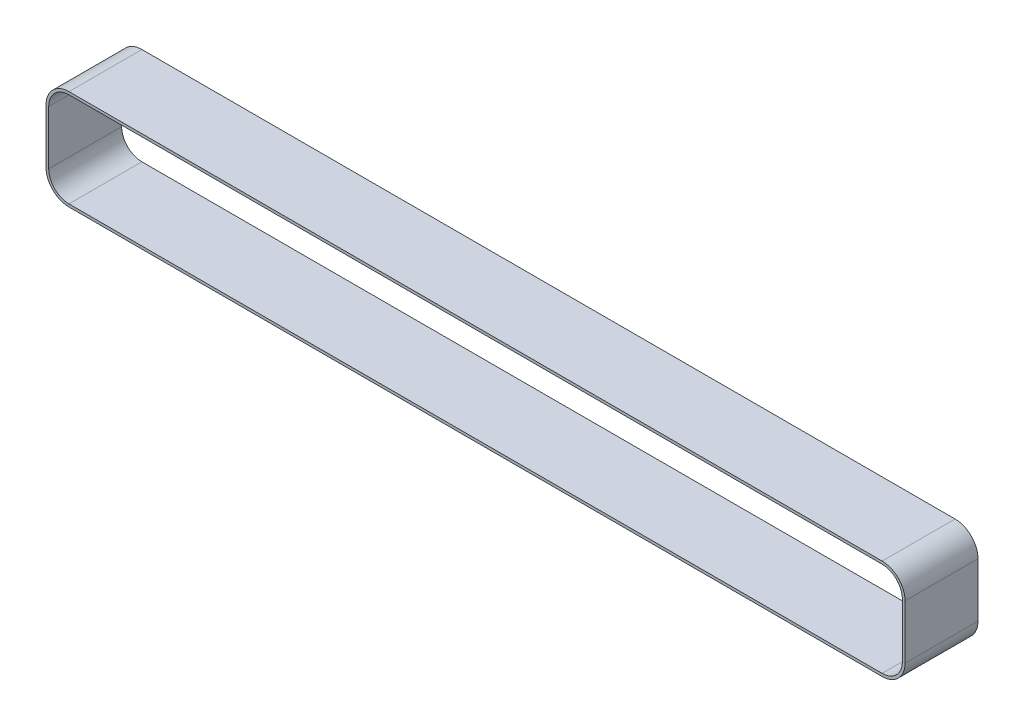
ISO-10303-21;
HEADER;
FILE_DESCRIPTION(('STEP AP214'),'2;1');
FILE_NAME('part.step','',(''),(''),'','','');
FILE_SCHEMA(('AUTOMOTIVE_DESIGN { 1 0 10303 214 1 1 1 1 }'));
ENDSEC;
DATA;
#1=APPLICATION_CONTEXT('core data for automotive mechanical design processes');
#2=APPLICATION_PROTOCOL_DEFINITION('international standard','automotive_design',2000,#1);
#3=PRODUCT_CONTEXT('',#1,'mechanical');
#4=PRODUCT('Part','Part','',(#3));
#5=PRODUCT_RELATED_PRODUCT_CATEGORY('part','',(#4));
#6=PRODUCT_DEFINITION_FORMATION('','',#4);
#7=PRODUCT_DEFINITION_CONTEXT('part definition',#1,'design');
#8=PRODUCT_DEFINITION('design','',#6,#7);
#9=PRODUCT_DEFINITION_SHAPE('','',#8);
#10=(LENGTH_UNIT() NAMED_UNIT(*) SI_UNIT(.MILLI.,.METRE.));
#11=(NAMED_UNIT(*) PLANE_ANGLE_UNIT() SI_UNIT($,.RADIAN.));
#12=(NAMED_UNIT(*) SI_UNIT($,.STERADIAN.) SOLID_ANGLE_UNIT());
#13=UNCERTAINTY_MEASURE_WITH_UNIT(LENGTH_MEASURE(1.E-05),#10,'distance_accuracy_value','');
#14=(GEOMETRIC_REPRESENTATION_CONTEXT(3) GLOBAL_UNCERTAINTY_ASSIGNED_CONTEXT((#13)) GLOBAL_UNIT_ASSIGNED_CONTEXT((#10,
#11,#12)) REPRESENTATION_CONTEXT('',''));
#15=CARTESIAN_POINT('',(0.,0.,0.));
#16=DIRECTION('',(0.,0.,1.));
#17=DIRECTION('',(1.,0.,0.));
#18=AXIS2_PLACEMENT_3D('',#15,#16,#17);
#19=CARTESIAN_POINT('',(371.394917120642,42.8157017452683,-232.556360518351));
#20=DIRECTION('',(1.,0.,0.));
#21=DIRECTION('',(0.,0.,-1.));
#22=AXIS2_PLACEMENT_3D('',#19,#20,#21);
#23=PLANE('',#22);
#24=DIRECTION('',(0.,1.,0.));
#25=VECTOR('',#24,1.);
#26=CARTESIAN_POINT('',(371.394917120642,60.3157017452683,-259.556360518351));
#27=LINE('',#26,#25);
#28=CARTESIAN_POINT('',(371.394917120642,52.8157017452683,-259.556360518351));
#29=VERTEX_POINT('',#28);
#30=CARTESIAN_POINT('',(371.394917120642,32.8157017452683,-259.556360518351));
#31=VERTEX_POINT('',#30);
#32=EDGE_CURVE('E178',#29,#31,#27,.F.);
#33=ORIENTED_EDGE('',*,*,#32,.F.);
#34=DIRECTION('',(0.,0.,-1.));
#35=VECTOR('',#34,1.);
#36=CARTESIAN_POINT('',(371.394917120642,52.8157017452683,-232.556360518351));
#37=LINE('',#36,#35);
#38=CARTESIAN_POINT('',(371.394917120642,52.8157017452683,-232.556360518351));
#39=VERTEX_POINT('',#38);
#40=EDGE_CURVE('E175',#29,#39,#37,.F.);
#41=ORIENTED_EDGE('',*,*,#40,.T.);
#42=DIRECTION('',(0.,1.,0.));
#43=VECTOR('',#42,1.);
#44=CARTESIAN_POINT('',(371.394917120642,58.9985567989127,-232.556360518351));
#45=LINE('',#44,#43);
#46=CARTESIAN_POINT('',(371.394917120642,32.8157017452683,-232.556360518351));
#47=VERTEX_POINT('',#46);
#48=EDGE_CURVE('E126',#39,#47,#45,.F.);
#49=ORIENTED_EDGE('',*,*,#48,.T.);
#50=DIRECTION('',(0.,0.,1.));
#51=VECTOR('',#50,1.);
#52=CARTESIAN_POINT('',(371.394917120642,32.8157017452683,-232.556360518351));
#53=LINE('',#52,#51);
#54=EDGE_CURVE('E136',#47,#31,#53,.F.);
#55=ORIENTED_EDGE('',*,*,#54,.T.);
#56=EDGE_LOOP('',(#33,#41,#49,#55));
#57=FACE_BOUND('',#56,.T.);
#58=ADVANCED_FACE('F17',(#57),#23,.T.);
#59=CARTESIAN_POINT('',(378.894917120642,32.8157017452683,-232.556360518351));
#60=DIRECTION('',(0.,0.,1.));
#61=DIRECTION('',(1.,0.,0.));
#62=AXIS2_PLACEMENT_3D('',#59,#60,#61);
#63=CYLINDRICAL_SURFACE('',#62,7.5);
#64=DIRECTION('',(0.,0.,1.));
#65=VECTOR('',#64,1.);
#66=CARTESIAN_POINT('',(378.894917120642,25.3157017452683,-232.556360518351));
#67=LINE('',#66,#65);
#68=CARTESIAN_POINT('',(378.894917120642,25.3157017452683,-259.556360518351));
#69=VERTEX_POINT('',#68);
#70=CARTESIAN_POINT('',(378.894917120642,25.3157017452683,-232.556360518351));
#71=VERTEX_POINT('',#70);
#72=EDGE_CURVE('E134',#69,#71,#67,.T.);
#73=ORIENTED_EDGE('',*,*,#72,.F.);
#74=CARTESIAN_POINT('',(378.894917120642,32.8157017452683,-259.556360518351));
#75=DIRECTION('',(0.,0.,1.));
#76=DIRECTION('',(1.,0.,0.));
#77=AXIS2_PLACEMENT_3D('',#74,#75,#76);
#78=CIRCLE('',#77,7.5);
#79=EDGE_CURVE('E220',#31,#69,#78,.T.);
#80=ORIENTED_EDGE('',*,*,#79,.F.);
#81=ORIENTED_EDGE('',*,*,#54,.F.);
#82=CARTESIAN_POINT('',(378.894917120642,32.8157017452683,-232.556360518351));
#83=DIRECTION('',(0.,0.,1.));
#84=DIRECTION('',(1.,0.,0.));
#85=AXIS2_PLACEMENT_3D('',#82,#83,#84);
#86=CIRCLE('',#85,7.5);
#87=EDGE_CURVE('E20',#47,#71,#86,.T.);
#88=ORIENTED_EDGE('',*,*,#87,.T.);
#89=EDGE_LOOP('',(#73,#80,#81,#88));
#90=FACE_BOUND('',#89,.T.);
#91=ADVANCED_FACE('F132',(#90),#63,.F.);
#92=CARTESIAN_POINT('',(679.894917120642,25.3157017452683,-232.556360518351));
#93=DIRECTION('',(0.,1.,0.));
#94=DIRECTION('',(0.,0.,1.));
#95=AXIS2_PLACEMENT_3D('',#92,#93,#94);
#96=PLANE('',#95);
#97=DIRECTION('',(-1.,0.,0.));
#98=VECTOR('',#97,1.);
#99=CARTESIAN_POINT('',(374.827683,25.3157017452683,-259.556360518351));
#100=LINE('',#99,#98);
#101=CARTESIAN_POINT('',(679.894917120642,25.3157017452683,-259.556360518351));
#102=VERTEX_POINT('',#101);
#103=EDGE_CURVE('E144',#69,#102,#100,.F.);
#104=ORIENTED_EDGE('',*,*,#103,.F.);
#105=ORIENTED_EDGE('',*,*,#72,.T.);
#106=DIRECTION('',(-1.,0.,0.));
#107=VECTOR('',#106,1.);
#108=CARTESIAN_POINT('',(450.519812437372,25.3157017452683,-232.556360518351));
#109=LINE('',#108,#107);
#110=CARTESIAN_POINT('',(679.894917120642,25.3157017452683,-232.556360518351));
#111=VERTEX_POINT('',#110);
#112=EDGE_CURVE('E139',#71,#111,#109,.F.);
#113=ORIENTED_EDGE('',*,*,#112,.T.);
#114=DIRECTION('',(0.,0.,1.));
#115=VECTOR('',#114,1.);
#116=CARTESIAN_POINT('',(679.894917120642,25.3157017452683,-232.556360518351));
#117=LINE('',#116,#115);
#118=EDGE_CURVE('E146',#111,#102,#117,.F.);
#119=ORIENTED_EDGE('',*,*,#118,.T.);
#120=EDGE_LOOP('',(#104,#105,#113,#119));
#121=FACE_BOUND('',#120,.T.);
#122=ADVANCED_FACE('F141',(#121),#96,.T.);
#123=CARTESIAN_POINT('',(679.894917120642,32.8157017452683,-232.556360518351));
#124=DIRECTION('',(0.,0.,1.));
#125=DIRECTION('',(1.,0.,0.));
#126=AXIS2_PLACEMENT_3D('',#123,#124,#125);
#127=CYLINDRICAL_SURFACE('',#126,7.5);
#128=DIRECTION('',(0.,0.,1.));
#129=VECTOR('',#128,1.);
#130=CARTESIAN_POINT('',(687.394917120642,32.8157017452683,-232.556360518351));
#131=LINE('',#130,#129);
#132=CARTESIAN_POINT('',(687.394917120642,32.8157017452683,-259.556360518351));
#133=VERTEX_POINT('',#132);
#134=CARTESIAN_POINT('',(687.394917120642,32.8157017452683,-232.556360518351));
#135=VERTEX_POINT('',#134);
#136=EDGE_CURVE('E188',#133,#135,#131,.T.);
#137=ORIENTED_EDGE('',*,*,#136,.F.);
#138=CARTESIAN_POINT('',(679.894917120642,32.8157017452683,-259.556360518351));
#139=DIRECTION('',(0.,0.,1.));
#140=DIRECTION('',(1.,0.,0.));
#141=AXIS2_PLACEMENT_3D('',#138,#139,#140);
#142=CIRCLE('',#141,7.5);
#143=EDGE_CURVE('E217',#102,#133,#142,.T.);
#144=ORIENTED_EDGE('',*,*,#143,.F.);
#145=ORIENTED_EDGE('',*,*,#118,.F.);
#146=CARTESIAN_POINT('',(679.894917120642,32.8157017452683,-232.556360518351));
#147=DIRECTION('',(0.,0.,1.));
#148=DIRECTION('',(1.,0.,0.));
#149=AXIS2_PLACEMENT_3D('',#146,#147,#148);
#150=CIRCLE('',#149,7.5);
#151=EDGE_CURVE('E152',#111,#135,#150,.T.);
#152=ORIENTED_EDGE('',*,*,#151,.T.);
#153=EDGE_LOOP('',(#137,#144,#145,#152));
#154=FACE_BOUND('',#153,.T.);
#155=ADVANCED_FACE('F416',(#154),#127,.F.);
#156=CARTESIAN_POINT('',(687.394917120642,42.8157017452683,-232.556360518351));
#157=DIRECTION('',(-1.,0.,0.));
#158=DIRECTION('',(0.,0.,1.));
#159=AXIS2_PLACEMENT_3D('',#156,#157,#158);
#160=PLANE('',#159);
#161=DIRECTION('',(0.,1.,0.));
#162=VECTOR('',#161,1.);
#163=CARTESIAN_POINT('',(687.394917120642,60.3157017452683,-259.556360518351));
#164=LINE('',#163,#162);
#165=CARTESIAN_POINT('',(687.394917120642,52.8157017452683,-259.556360518351));
#166=VERTEX_POINT('',#165);
#167=EDGE_CURVE('E216',#133,#166,#164,.T.);
#168=ORIENTED_EDGE('',*,*,#167,.F.);
#169=ORIENTED_EDGE('',*,*,#136,.T.);
#170=DIRECTION('',(0.,1.,0.));
#171=VECTOR('',#170,1.);
#172=CARTESIAN_POINT('',(687.394917120642,58.9985567989127,-232.556360518351));
#173=LINE('',#172,#171);
#174=CARTESIAN_POINT('',(687.394917120642,52.8157017452683,-232.556360518351));
#175=VERTEX_POINT('',#174);
#176=EDGE_CURVE('E154',#135,#175,#173,.T.);
#177=ORIENTED_EDGE('',*,*,#176,.T.);
#178=DIRECTION('',(0.,0.,-1.));
#179=VECTOR('',#178,1.);
#180=CARTESIAN_POINT('',(687.394917120642,52.8157017452683,-232.556360518351));
#181=LINE('',#180,#179);
#182=EDGE_CURVE('E186',#175,#166,#181,.T.);
#183=ORIENTED_EDGE('',*,*,#182,.T.);
#184=EDGE_LOOP('',(#168,#169,#177,#183));
#185=FACE_BOUND('',#184,.T.);
#186=ADVANCED_FACE('F241',(#185),#160,.T.);
#187=CARTESIAN_POINT('',(679.894917120642,52.8157017452683,-232.556360518351));
#188=DIRECTION('',(0.,0.,-1.));
#189=DIRECTION('',(-1.,0.,0.));
#190=AXIS2_PLACEMENT_3D('',#187,#188,#189);
#191=CYLINDRICAL_SURFACE('',#190,7.5);
#192=DIRECTION('',(0.,0.,-1.));
#193=VECTOR('',#192,1.);
#194=CARTESIAN_POINT('',(679.894917120642,60.3157017452683,-232.556360518351));
#195=LINE('',#194,#193);
#196=CARTESIAN_POINT('',(679.894917120642,60.3157017452683,-259.556360518351));
#197=VERTEX_POINT('',#196);
#198=CARTESIAN_POINT('',(679.894917120642,60.3157017452683,-232.556360518351));
#199=VERTEX_POINT('',#198);
#200=EDGE_CURVE('E182',#197,#199,#195,.F.);
#201=ORIENTED_EDGE('',*,*,#200,.F.);
#202=CARTESIAN_POINT('',(679.894917120642,52.8157017452683,-259.556360518351));
#203=DIRECTION('',(0.,0.,-1.));
#204=DIRECTION('',(-1.,0.,0.));
#205=AXIS2_PLACEMENT_3D('',#202,#203,#204);
#206=CIRCLE('',#205,7.5);
#207=EDGE_CURVE('E213',#166,#197,#206,.F.);
#208=ORIENTED_EDGE('',*,*,#207,.F.);
#209=ORIENTED_EDGE('',*,*,#182,.F.);
#210=CARTESIAN_POINT('',(679.894917120642,52.8157017452683,-232.556360518351));
#211=DIRECTION('',(0.,0.,-1.));
#212=DIRECTION('',(-1.,0.,0.));
#213=AXIS2_PLACEMENT_3D('',#210,#211,#212);
#214=CIRCLE('',#213,7.5);
#215=EDGE_CURVE('E235',#175,#199,#214,.F.);
#216=ORIENTED_EDGE('',*,*,#215,.T.);
#217=EDGE_LOOP('',(#201,#208,#209,#216));
#218=FACE_BOUND('',#217,.T.);
#219=ADVANCED_FACE('F243',(#218),#191,.F.);
#220=CARTESIAN_POINT('',(378.894917120642,60.3157017452683,-232.556360518351));
#221=DIRECTION('',(0.,-1.,0.));
#222=DIRECTION('',(0.,0.,-1.));
#223=AXIS2_PLACEMENT_3D('',#220,#221,#222);
#224=PLANE('',#223);
#225=DIRECTION('',(-1.,0.,0.));
#226=VECTOR('',#225,1.);
#227=CARTESIAN_POINT('',(374.827683,60.3157017452683,-259.556360518351));
#228=LINE('',#227,#226);
#229=CARTESIAN_POINT('',(378.894917120642,60.3157017452683,-259.556360518351));
#230=VERTEX_POINT('',#229);
#231=EDGE_CURVE('E212',#197,#230,#228,.T.);
#232=ORIENTED_EDGE('',*,*,#231,.F.);
#233=ORIENTED_EDGE('',*,*,#200,.T.);
#234=DIRECTION('',(-1.,0.,0.));
#235=VECTOR('',#234,1.);
#236=CARTESIAN_POINT('',(450.519812437372,60.3157017452683,-232.556360518351));
#237=LINE('',#236,#235);
#238=CARTESIAN_POINT('',(378.894917120642,60.3157017452683,-232.556360518351));
#239=VERTEX_POINT('',#238);
#240=EDGE_CURVE('E234',#199,#239,#237,.T.);
#241=ORIENTED_EDGE('',*,*,#240,.T.);
#242=DIRECTION('',(0.,0.,-1.));
#243=VECTOR('',#242,1.);
#244=CARTESIAN_POINT('',(378.894917120642,60.3157017452683,-232.556360518351));
#245=LINE('',#244,#243);
#246=EDGE_CURVE('E180',#239,#230,#245,.T.);
#247=ORIENTED_EDGE('',*,*,#246,.T.);
#248=EDGE_LOOP('',(#232,#233,#241,#247));
#249=FACE_BOUND('',#248,.T.);
#250=ADVANCED_FACE('F249',(#249),#224,.T.);
#251=CARTESIAN_POINT('',(378.894917120642,52.8157017452683,-232.556360518351));
#252=DIRECTION('',(0.,0.,-1.));
#253=DIRECTION('',(-1.,0.,0.));
#254=AXIS2_PLACEMENT_3D('',#251,#252,#253);
#255=CYLINDRICAL_SURFACE('',#254,7.5);
#256=ORIENTED_EDGE('',*,*,#40,.F.);
#257=CARTESIAN_POINT('',(378.894917120642,52.8157017452683,-259.556360518351));
#258=DIRECTION('',(0.,0.,-1.));
#259=DIRECTION('',(-1.,0.,0.));
#260=AXIS2_PLACEMENT_3D('',#257,#258,#259);
#261=CIRCLE('',#260,7.5);
#262=EDGE_CURVE('E209',#230,#29,#261,.F.);
#263=ORIENTED_EDGE('',*,*,#262,.F.);
#264=ORIENTED_EDGE('',*,*,#246,.F.);
#265=CARTESIAN_POINT('',(378.894917120642,52.8157017452683,-232.556360518351));
#266=DIRECTION('',(0.,0.,-1.));
#267=DIRECTION('',(-1.,0.,0.));
#268=AXIS2_PLACEMENT_3D('',#265,#266,#267);
#269=CIRCLE('',#268,7.5);
#270=EDGE_CURVE('E231',#239,#39,#269,.F.);
#271=ORIENTED_EDGE('',*,*,#270,.T.);
#272=EDGE_LOOP('',(#256,#263,#264,#271));
#273=FACE_BOUND('',#272,.T.);
#274=ADVANCED_FACE('F253',(#273),#255,.F.);
#275=CARTESIAN_POINT('',(370.394917120642,42.8157017452683,-232.556360518351));
#276=DIRECTION('',(-1.,0.,0.));
#277=DIRECTION('',(0.,0.,1.));
#278=AXIS2_PLACEMENT_3D('',#275,#276,#277);
#279=PLANE('',#278);
#280=DIRECTION('',(0.,1.,0.));
#281=VECTOR('',#280,1.);
#282=CARTESIAN_POINT('',(370.394917120642,60.3157017452683,-259.556360518351));
#283=LINE('',#282,#281);
#284=CARTESIAN_POINT('',(370.394917120642,32.8157017452683,-259.556360518351));
#285=VERTEX_POINT('',#284);
#286=CARTESIAN_POINT('',(370.394917120642,52.8157017452683,-259.556360518351));
#287=VERTEX_POINT('',#286);
#288=EDGE_CURVE('E205',#285,#287,#283,.T.);
#289=ORIENTED_EDGE('',*,*,#288,.F.);
#290=DIRECTION('',(0.,0.,1.));
#291=VECTOR('',#290,1.);
#292=CARTESIAN_POINT('',(370.394917120642,32.8157017452683,-232.556360518351));
#293=LINE('',#292,#291);
#294=CARTESIAN_POINT('',(370.394917120642,32.8157017452683,-232.556360518351));
#295=VERTEX_POINT('',#294);
#296=EDGE_CURVE('E176',#295,#285,#293,.F.);
#297=ORIENTED_EDGE('',*,*,#296,.F.);
#298=DIRECTION('',(0.,1.,0.));
#299=VECTOR('',#298,1.);
#300=CARTESIAN_POINT('',(370.394917120642,58.9985567989127,-232.556360518351));
#301=LINE('',#300,#299);
#302=CARTESIAN_POINT('',(370.394917120642,52.8157017452683,-232.556360518351));
#303=VERTEX_POINT('',#302);
#304=EDGE_CURVE('E230',#295,#303,#301,.T.);
#305=ORIENTED_EDGE('',*,*,#304,.T.);
#306=DIRECTION('',(0.,0.,-1.));
#307=VECTOR('',#306,1.);
#308=CARTESIAN_POINT('',(370.394917120642,52.8157017452683,-232.556360518351));
#309=LINE('',#308,#307);
#310=EDGE_CURVE('E172',#287,#303,#309,.F.);
#311=ORIENTED_EDGE('',*,*,#310,.F.);
#312=EDGE_LOOP('',(#289,#297,#305,#311));
#313=FACE_BOUND('',#312,.T.);
#314=ADVANCED_FACE('F277',(#313),#279,.T.);
#315=CARTESIAN_POINT('',(378.894917120642,52.8157017452683,-232.556360518351));
#316=DIRECTION('',(0.,0.,-1.));
#317=DIRECTION('',(-1.,0.,0.));
#318=AXIS2_PLACEMENT_3D('',#315,#316,#317);
#319=CYLINDRICAL_SURFACE('',#318,8.5);
#320=CARTESIAN_POINT('',(378.894917120642,52.8157017452683,-259.556360518351));
#321=DIRECTION('',(0.,0.,-1.));
#322=DIRECTION('',(-1.,0.,0.));
#323=AXIS2_PLACEMENT_3D('',#320,#321,#322);
#324=CIRCLE('',#323,8.5);
#325=CARTESIAN_POINT('',(378.894917120642,61.3157017452683,-259.556360518351));
#326=VERTEX_POINT('',#325);
#327=EDGE_CURVE('E202',#287,#326,#324,.T.);
#328=ORIENTED_EDGE('',*,*,#327,.F.);
#329=ORIENTED_EDGE('',*,*,#310,.T.);
#330=CARTESIAN_POINT('',(378.894917120642,52.8157017452683,-232.556360518351));
#331=DIRECTION('',(0.,0.,-1.));
#332=DIRECTION('',(-1.,0.,0.));
#333=AXIS2_PLACEMENT_3D('',#330,#331,#332);
#334=CIRCLE('',#333,8.5);
#335=CARTESIAN_POINT('',(378.894917120642,61.3157017452683,-232.556360518351));
#336=VERTEX_POINT('',#335);
#337=EDGE_CURVE('E228',#303,#336,#334,.T.);
#338=ORIENTED_EDGE('',*,*,#337,.T.);
#339=DIRECTION('',(0.,0.,1.));
#340=VECTOR('',#339,1.);
#341=CARTESIAN_POINT('',(378.894917120642,61.3157017452683,-232.556360518351));
#342=LINE('',#341,#340);
#343=EDGE_CURVE('E169',#326,#336,#342,.T.);
#344=ORIENTED_EDGE('',*,*,#343,.F.);
#345=EDGE_LOOP('',(#328,#329,#338,#344));
#346=FACE_BOUND('',#345,.T.);
#347=ADVANCED_FACE('F282',(#346),#319,.T.);
#348=CARTESIAN_POINT('',(679.894917120642,61.3157017452683,-232.556360518351));
#349=DIRECTION('',(0.,1.,0.));
#350=DIRECTION('',(0.,0.,1.));
#351=AXIS2_PLACEMENT_3D('',#348,#349,#350);
#352=PLANE('',#351);
#353=DIRECTION('',(-1.,0.,0.));
#354=VECTOR('',#353,1.);
#355=CARTESIAN_POINT('',(374.827683,61.3157017452683,-259.556360518351));
#356=LINE('',#355,#354);
#357=CARTESIAN_POINT('',(679.894917120642,61.3157017452683,-259.556360518351));
#358=VERTEX_POINT('',#357);
#359=EDGE_CURVE('E201',#326,#358,#356,.F.);
#360=ORIENTED_EDGE('',*,*,#359,.F.);
#361=ORIENTED_EDGE('',*,*,#343,.T.);
#362=DIRECTION('',(-1.,0.,0.));
#363=VECTOR('',#362,1.);
#364=CARTESIAN_POINT('',(450.519812437372,61.3157017452683,-232.556360518351));
#365=LINE('',#364,#363);
#366=CARTESIAN_POINT('',(679.894917120642,61.3157017452683,-232.556360518351));
#367=VERTEX_POINT('',#366);
#368=EDGE_CURVE('E227',#336,#367,#365,.F.);
#369=ORIENTED_EDGE('',*,*,#368,.T.);
#370=DIRECTION('',(0.,0.,-1.));
#371=VECTOR('',#370,1.);
#372=CARTESIAN_POINT('',(679.894917120642,61.3157017452683,-232.556360518351));
#373=LINE('',#372,#371);
#374=EDGE_CURVE('E166',#358,#367,#373,.F.);
#375=ORIENTED_EDGE('',*,*,#374,.F.);
#376=EDGE_LOOP('',(#360,#361,#369,#375));
#377=FACE_BOUND('',#376,.T.);
#378=ADVANCED_FACE('F290',(#377),#352,.T.);
#379=CARTESIAN_POINT('',(679.894917120642,52.8157017452683,-232.556360518351));
#380=DIRECTION('',(0.,0.,-1.));
#381=DIRECTION('',(-1.,0.,0.));
#382=AXIS2_PLACEMENT_3D('',#379,#380,#381);
#383=CYLINDRICAL_SURFACE('',#382,8.5);
#384=CARTESIAN_POINT('',(679.894917120642,52.8157017452683,-259.556360518351));
#385=DIRECTION('',(0.,0.,-1.));
#386=DIRECTION('',(-1.,0.,0.));
#387=AXIS2_PLACEMENT_3D('',#384,#385,#386);
#388=CIRCLE('',#387,8.5);
#389=CARTESIAN_POINT('',(688.394917120642,52.8157017452683,-259.556360518351));
#390=VERTEX_POINT('',#389);
#391=EDGE_CURVE('E198',#358,#390,#388,.T.);
#392=ORIENTED_EDGE('',*,*,#391,.F.);
#393=ORIENTED_EDGE('',*,*,#374,.T.);
#394=CARTESIAN_POINT('',(679.894917120642,52.8157017452683,-232.556360518351));
#395=DIRECTION('',(0.,0.,-1.));
#396=DIRECTION('',(-1.,0.,0.));
#397=AXIS2_PLACEMENT_3D('',#394,#395,#396);
#398=CIRCLE('',#397,8.5);
#399=CARTESIAN_POINT('',(688.394917120642,52.8157017452683,-232.556360518351));
#400=VERTEX_POINT('',#399);
#401=EDGE_CURVE('E225',#367,#400,#398,.T.);
#402=ORIENTED_EDGE('',*,*,#401,.T.);
#403=DIRECTION('',(0.,0.,-1.));
#404=VECTOR('',#403,1.);
#405=CARTESIAN_POINT('',(688.394917120642,52.8157017452683,-232.556360518351));
#406=LINE('',#405,#404);
#407=EDGE_CURVE('E159',#390,#400,#406,.F.);
#408=ORIENTED_EDGE('',*,*,#407,.F.);
#409=EDGE_LOOP('',(#392,#393,#402,#408));
#410=FACE_BOUND('',#409,.T.);
#411=ADVANCED_FACE('F293',(#410),#383,.T.);
#412=CARTESIAN_POINT('',(688.394917120642,42.8157017452683,-232.556360518351));
#413=DIRECTION('',(1.,0.,0.));
#414=DIRECTION('',(0.,0.,-1.));
#415=AXIS2_PLACEMENT_3D('',#412,#413,#414);
#416=PLANE('',#415);
#417=DIRECTION('',(0.,1.,0.));
#418=VECTOR('',#417,1.);
#419=CARTESIAN_POINT('',(688.394917120642,60.3157017452683,-259.556360518351));
#420=LINE('',#419,#418);
#421=CARTESIAN_POINT('',(688.394917120642,32.8157017452683,-259.556360518351));
#422=VERTEX_POINT('',#421);
#423=EDGE_CURVE('E197',#390,#422,#420,.F.);
#424=ORIENTED_EDGE('',*,*,#423,.F.);
#425=ORIENTED_EDGE('',*,*,#407,.T.);
#426=DIRECTION('',(0.,1.,0.));
#427=VECTOR('',#426,1.);
#428=CARTESIAN_POINT('',(688.394917120642,58.9985567989127,-232.556360518351));
#429=LINE('',#428,#427);
#430=CARTESIAN_POINT('',(688.394917120642,32.8157017452683,-232.556360518351));
#431=VERTEX_POINT('',#430);
#432=EDGE_CURVE('E224',#400,#431,#429,.F.);
#433=ORIENTED_EDGE('',*,*,#432,.T.);
#434=DIRECTION('',(0.,0.,1.));
#435=VECTOR('',#434,1.);
#436=CARTESIAN_POINT('',(688.394917120642,32.8157017452683,-232.556360518351));
#437=LINE('',#436,#435);
#438=EDGE_CURVE('E160',#422,#431,#437,.T.);
#439=ORIENTED_EDGE('',*,*,#438,.F.);
#440=EDGE_LOOP('',(#424,#425,#433,#439));
#441=FACE_BOUND('',#440,.T.);
#442=ADVANCED_FACE('F299',(#441),#416,.T.);
#443=CARTESIAN_POINT('',(450.519812437372,58.9985567989127,-232.556360518351));
#444=DIRECTION('',(0.,0.,-1.));
#445=DIRECTION('',(-1.,0.,0.));
#446=AXIS2_PLACEMENT_3D('',#443,#444,#445);
#447=PLANE('',#446);
#448=CARTESIAN_POINT('',(679.894917120642,32.8157017452683,-232.556360518351));
#449=DIRECTION('',(0.,0.,1.));
#450=DIRECTION('',(1.,0.,0.));
#451=AXIS2_PLACEMENT_3D('',#448,#449,#450);
#452=CIRCLE('',#451,8.5);
#453=CARTESIAN_POINT('',(679.894917120642,24.3157017452683,-232.556360518351));
#454=VERTEX_POINT('',#453);
#455=EDGE_CURVE('E194',#431,#454,#452,.F.);
#456=ORIENTED_EDGE('',*,*,#455,.F.);
#457=ORIENTED_EDGE('',*,*,#432,.F.);
#458=ORIENTED_EDGE('',*,*,#401,.F.);
#459=ORIENTED_EDGE('',*,*,#368,.F.);
#460=ORIENTED_EDGE('',*,*,#337,.F.);
#461=ORIENTED_EDGE('',*,*,#304,.F.);
#462=CARTESIAN_POINT('',(378.894917120642,32.8157017452683,-232.556360518351));
#463=DIRECTION('',(0.,0.,1.));
#464=DIRECTION('',(1.,0.,0.));
#465=AXIS2_PLACEMENT_3D('',#462,#463,#464);
#466=CIRCLE('',#465,8.5);
#467=CARTESIAN_POINT('',(378.894917120642,24.3157017452683,-232.556360518351));
#468=VERTEX_POINT('',#467);
#469=EDGE_CURVE('E179',#468,#295,#466,.F.);
#470=ORIENTED_EDGE('',*,*,#469,.F.);
#471=DIRECTION('',(1.,0.,0.));
#472=VECTOR('',#471,1.);
#473=CARTESIAN_POINT('',(378.894917120642,24.3157017452683,-232.556360518351));
#474=LINE('',#473,#472);
#475=EDGE_CURVE('E163',#454,#468,#474,.F.);
#476=ORIENTED_EDGE('',*,*,#475,.F.);
#477=EDGE_LOOP('',(#456,#457,#458,#459,#460,#461,#470,#476));
#478=FACE_BOUND('',#477,.T.);
#479=ORIENTED_EDGE('',*,*,#240,.F.);
#480=ORIENTED_EDGE('',*,*,#215,.F.);
#481=ORIENTED_EDGE('',*,*,#176,.F.);
#482=ORIENTED_EDGE('',*,*,#151,.F.);
#483=ORIENTED_EDGE('',*,*,#112,.F.);
#484=ORIENTED_EDGE('',*,*,#87,.F.);
#485=ORIENTED_EDGE('',*,*,#48,.F.);
#486=ORIENTED_EDGE('',*,*,#270,.F.);
#487=EDGE_LOOP('',(#479,#480,#481,#482,#483,#484,#485,#486));
#488=FACE_BOUND('',#487,.T.);
#489=ADVANCED_FACE('F150',(#478,#488),#447,.F.);
#490=CARTESIAN_POINT('',(378.894917120642,32.8157017452683,-232.556360518351));
#491=DIRECTION('',(0.,0.,1.));
#492=DIRECTION('',(1.,0.,0.));
#493=AXIS2_PLACEMENT_3D('',#490,#491,#492);
#494=CYLINDRICAL_SURFACE('',#493,8.5);
#495=CARTESIAN_POINT('',(378.894917120642,32.8157017452683,-259.556360518351));
#496=DIRECTION('',(0.,0.,1.));
#497=DIRECTION('',(1.,0.,0.));
#498=AXIS2_PLACEMENT_3D('',#495,#496,#497);
#499=CIRCLE('',#498,8.5);
#500=CARTESIAN_POINT('',(378.894917120642,24.3157017452683,-259.556360518351));
#501=VERTEX_POINT('',#500);
#502=EDGE_CURVE('E206',#501,#285,#499,.F.);
#503=ORIENTED_EDGE('',*,*,#502,.F.);
#504=DIRECTION('',(0.,0.,-1.));
#505=VECTOR('',#504,1.);
#506=CARTESIAN_POINT('',(378.894917120642,24.3157017452683,-232.556360518351));
#507=LINE('',#506,#505);
#508=EDGE_CURVE('E265',#468,#501,#507,.T.);
#509=ORIENTED_EDGE('',*,*,#508,.F.);
#510=ORIENTED_EDGE('',*,*,#469,.T.);
#511=ORIENTED_EDGE('',*,*,#296,.T.);
#512=EDGE_LOOP('',(#503,#509,#510,#511));
#513=FACE_BOUND('',#512,.T.);
#514=ADVANCED_FACE('F306',(#513),#494,.T.);
#515=CARTESIAN_POINT('',(374.827683,60.3157017452683,-259.556360518351));
#516=DIRECTION('',(0.,0.,-1.));
#517=DIRECTION('',(-1.,0.,0.));
#518=AXIS2_PLACEMENT_3D('',#515,#516,#517);
#519=PLANE('',#518);
#520=CARTESIAN_POINT('',(679.894917120642,32.8157017452683,-259.556360518351));
#521=DIRECTION('',(0.,0.,1.));
#522=DIRECTION('',(1.,0.,0.));
#523=AXIS2_PLACEMENT_3D('',#520,#521,#522);
#524=CIRCLE('',#523,8.5);
#525=CARTESIAN_POINT('',(679.894917120642,24.3157017452683,-259.556360518351));
#526=VERTEX_POINT('',#525);
#527=EDGE_CURVE('E35',#526,#422,#524,.T.);
#528=ORIENTED_EDGE('',*,*,#527,.F.);
#529=DIRECTION('',(1.,0.,0.));
#530=VECTOR('',#529,1.);
#531=CARTESIAN_POINT('',(378.894917120642,24.3157017452683,-259.556360518351));
#532=LINE('',#531,#530);
#533=EDGE_CURVE('E26',#501,#526,#532,.T.);
#534=ORIENTED_EDGE('',*,*,#533,.F.);
#535=ORIENTED_EDGE('',*,*,#502,.T.);
#536=ORIENTED_EDGE('',*,*,#288,.T.);
#537=ORIENTED_EDGE('',*,*,#327,.T.);
#538=ORIENTED_EDGE('',*,*,#359,.T.);
#539=ORIENTED_EDGE('',*,*,#391,.T.);
#540=ORIENTED_EDGE('',*,*,#423,.T.);
#541=EDGE_LOOP('',(#528,#534,#535,#536,#537,#538,#539,#540));
#542=FACE_BOUND('',#541,.T.);
#543=ORIENTED_EDGE('',*,*,#231,.T.);
#544=ORIENTED_EDGE('',*,*,#262,.T.);
#545=ORIENTED_EDGE('',*,*,#32,.T.);
#546=ORIENTED_EDGE('',*,*,#79,.T.);
#547=ORIENTED_EDGE('',*,*,#103,.T.);
#548=ORIENTED_EDGE('',*,*,#143,.T.);
#549=ORIENTED_EDGE('',*,*,#167,.T.);
#550=ORIENTED_EDGE('',*,*,#207,.T.);
#551=EDGE_LOOP('',(#543,#544,#545,#546,#547,#548,#549,#550));
#552=FACE_BOUND('',#551,.T.);
#553=ADVANCED_FACE('F257',(#542,#552),#519,.T.);
#554=CARTESIAN_POINT('',(679.894917120642,32.8157017452683,-232.556360518351));
#555=DIRECTION('',(0.,0.,1.));
#556=DIRECTION('',(1.,0.,0.));
#557=AXIS2_PLACEMENT_3D('',#554,#555,#556);
#558=CYLINDRICAL_SURFACE('',#557,8.5);
#559=ORIENTED_EDGE('',*,*,#527,.T.);
#560=ORIENTED_EDGE('',*,*,#438,.T.);
#561=ORIENTED_EDGE('',*,*,#455,.T.);
#562=DIRECTION('',(0.,0.,-1.));
#563=VECTOR('',#562,1.);
#564=CARTESIAN_POINT('',(679.894917120642,24.3157017452683,-232.556360518351));
#565=LINE('',#564,#563);
#566=EDGE_CURVE('E11',#526,#454,#565,.F.);
#567=ORIENTED_EDGE('',*,*,#566,.F.);
#568=EDGE_LOOP('',(#559,#560,#561,#567));
#569=FACE_BOUND('',#568,.T.);
#570=ADVANCED_FACE('F301',(#569),#558,.T.);
#571=CARTESIAN_POINT('',(378.894917120642,24.3157017452683,-232.556360518351));
#572=DIRECTION('',(0.,-1.,0.));
#573=DIRECTION('',(0.,0.,-1.));
#574=AXIS2_PLACEMENT_3D('',#571,#572,#573);
#575=PLANE('',#574);
#576=ORIENTED_EDGE('',*,*,#533,.T.);
#577=ORIENTED_EDGE('',*,*,#566,.T.);
#578=ORIENTED_EDGE('',*,*,#475,.T.);
#579=ORIENTED_EDGE('',*,*,#508,.T.);
#580=EDGE_LOOP('',(#576,#577,#578,#579));
#581=FACE_BOUND('',#580,.T.);
#582=ADVANCED_FACE('F303',(#581),#575,.T.);
#583=CLOSED_SHELL('',(#58,#91,#122,#155,#186,#219,#250,#274,#314,#347,#378,#411,#442,#489,#514,
#553,#570,#582));
#584=MANIFOLD_SOLID_BREP('B1',#583);
#585=ADVANCED_BREP_SHAPE_REPRESENTATION('',(#18,#584),#14);
#586=SHAPE_DEFINITION_REPRESENTATION(#9,#585);
ENDSEC;
END-ISO-10303-21;
